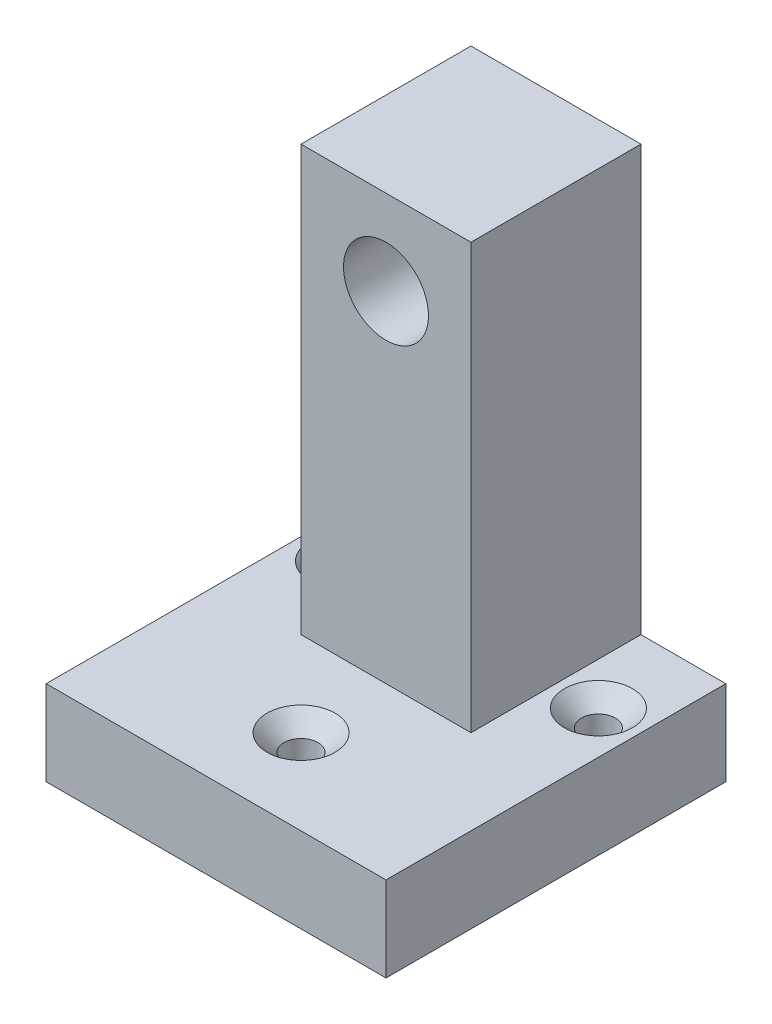
ISO-10303-21;
HEADER;
FILE_DESCRIPTION(('STEP AP214'),'2;1');
FILE_NAME('part.step','',(''),(''),'','','');
FILE_SCHEMA(('AUTOMOTIVE_DESIGN { 1 0 10303 214 1 1 1 1 }'));
ENDSEC;
DATA;
#1=APPLICATION_CONTEXT('core data for automotive mechanical design processes');
#2=APPLICATION_PROTOCOL_DEFINITION('international standard','automotive_design',2000,#1);
#3=PRODUCT_CONTEXT('',#1,'mechanical');
#4=PRODUCT('Part','Part','',(#3));
#5=PRODUCT_RELATED_PRODUCT_CATEGORY('part','',(#4));
#6=PRODUCT_DEFINITION_FORMATION('','',#4);
#7=PRODUCT_DEFINITION_CONTEXT('part definition',#1,'design');
#8=PRODUCT_DEFINITION('design','',#6,#7);
#9=PRODUCT_DEFINITION_SHAPE('','',#8);
#10=(LENGTH_UNIT() NAMED_UNIT(*) SI_UNIT(.MILLI.,.METRE.));
#11=(NAMED_UNIT(*) PLANE_ANGLE_UNIT() SI_UNIT($,.RADIAN.));
#12=(NAMED_UNIT(*) SI_UNIT($,.STERADIAN.) SOLID_ANGLE_UNIT());
#13=UNCERTAINTY_MEASURE_WITH_UNIT(LENGTH_MEASURE(1.E-05),#10,'distance_accuracy_value','');
#14=(GEOMETRIC_REPRESENTATION_CONTEXT(3) GLOBAL_UNCERTAINTY_ASSIGNED_CONTEXT((#13)) GLOBAL_UNIT_ASSIGNED_CONTEXT((#10,
#11,#12)) REPRESENTATION_CONTEXT('',''));
#15=CARTESIAN_POINT('',(0.,0.,0.));
#16=DIRECTION('',(0.,0.,1.));
#17=DIRECTION('',(1.,0.,0.));
#18=AXIS2_PLACEMENT_3D('',#15,#16,#17);
#19=CARTESIAN_POINT('',(-1.95424017064453,6.,2.));
#20=DIRECTION('',(0.,-1.,0.));
#21=DIRECTION('',(0.,0.,-1.));
#22=AXIS2_PLACEMENT_3D('',#19,#20,#21);
#23=PLANE('',#22);
#24=DIRECTION('',(-1.,0.,0.));
#25=VECTOR('',#24,1.);
#26=CARTESIAN_POINT('',(-1.95424017064453,6.,0.));
#27=LINE('',#26,#25);
#28=CARTESIAN_POINT('',(-1.95424017064453,6.,0.));
#29=VERTEX_POINT('',#28);
#30=CARTESIAN_POINT('',(-3.95424017064453,6.,0.));
#31=VERTEX_POINT('',#30);
#32=EDGE_CURVE('E143',#29,#31,#27,.T.);
#33=ORIENTED_EDGE('',*,*,#32,.T.);
#34=DIRECTION('',(0.,0.,-1.));
#35=VECTOR('',#34,1.);
#36=CARTESIAN_POINT('',(-3.95424017064453,6.,2.));
#37=LINE('',#36,#35);
#38=CARTESIAN_POINT('',(-3.95424017064453,6.,2.));
#39=VERTEX_POINT('',#38);
#40=EDGE_CURVE('E168',#39,#31,#37,.T.);
#41=ORIENTED_EDGE('',*,*,#40,.F.);
#42=DIRECTION('',(-1.,0.,0.));
#43=VECTOR('',#42,1.);
#44=CARTESIAN_POINT('',(-1.95424017064453,6.,2.));
#45=LINE('',#44,#43);
#46=CARTESIAN_POINT('',(-1.95424017064453,6.,2.));
#47=VERTEX_POINT('',#46);
#48=EDGE_CURVE('E144',#47,#39,#45,.T.);
#49=ORIENTED_EDGE('',*,*,#48,.F.);
#50=DIRECTION('',(0.,0.,-1.));
#51=VECTOR('',#50,1.);
#52=CARTESIAN_POINT('',(-1.95424017064453,6.,2.));
#53=LINE('',#52,#51);
#54=EDGE_CURVE('E159',#47,#29,#53,.T.);
#55=ORIENTED_EDGE('',*,*,#54,.T.);
#56=EDGE_LOOP('',(#33,#41,#49,#55));
#57=FACE_BOUND('',#56,.T.);
#58=ADVANCED_FACE('F33',(#57),#23,.F.);
#59=CARTESIAN_POINT('',(-3.95424017064453,6.,2.));
#60=DIRECTION('',(1.,0.,0.));
#61=DIRECTION('',(0.,1.,0.));
#62=AXIS2_PLACEMENT_3D('',#59,#60,#61);
#63=PLANE('',#62);
#64=CARTESIAN_POINT('',(-3.95424017064453,5.,1.));
#65=DIRECTION('',(-1.,0.,0.));
#66=DIRECTION('',(0.,-1.,0.));
#67=AXIS2_PLACEMENT_3D('',#64,#65,#66);
#68=CIRCLE('',#67,0.2);
#69=CARTESIAN_POINT('',(-3.95424017064453,4.8,1.));
#70=VERTEX_POINT('',#69);
#71=EDGE_CURVE('E195',#70,#70,#68,.T.);
#72=ORIENTED_EDGE('',*,*,#71,.F.);
#73=EDGE_LOOP('',(#72));
#74=FACE_BOUND('',#73,.T.);
#75=DIRECTION('',(0.,-1.,0.));
#76=VECTOR('',#75,1.);
#77=CARTESIAN_POINT('',(-3.95424017064453,6.,0.));
#78=LINE('',#77,#76);
#79=CARTESIAN_POINT('',(-3.95424017064453,1.,0.));
#80=VERTEX_POINT('',#79);
#81=EDGE_CURVE('E148',#31,#80,#78,.T.);
#82=ORIENTED_EDGE('',*,*,#81,.T.);
#83=DIRECTION('',(0.,0.,-1.));
#84=VECTOR('',#83,1.);
#85=CARTESIAN_POINT('',(-3.95424017064453,1.,2.));
#86=LINE('',#85,#84);
#87=CARTESIAN_POINT('',(-3.95424017064453,1.,2.));
#88=VERTEX_POINT('',#87);
#89=EDGE_CURVE('E119',#88,#80,#86,.T.);
#90=ORIENTED_EDGE('',*,*,#89,.F.);
#91=DIRECTION('',(0.,-1.,0.));
#92=VECTOR('',#91,1.);
#93=CARTESIAN_POINT('',(-3.95424017064453,6.,2.));
#94=LINE('',#93,#92);
#95=EDGE_CURVE('E94',#39,#88,#94,.T.);
#96=ORIENTED_EDGE('',*,*,#95,.F.);
#97=ORIENTED_EDGE('',*,*,#40,.T.);
#98=EDGE_LOOP('',(#82,#90,#96,#97));
#99=FACE_BOUND('',#98,.T.);
#100=ADVANCED_FACE('F226',(#74,#99),#63,.F.);
#101=CARTESIAN_POINT('',(-4.95424017064453,1.,2.));
#102=DIRECTION('',(1.,0.,0.));
#103=DIRECTION('',(0.,0.,-1.));
#104=AXIS2_PLACEMENT_3D('',#101,#102,#103);
#105=PLANE('',#104);
#106=DIRECTION('',(0.,-1.,0.));
#107=VECTOR('',#106,1.);
#108=CARTESIAN_POINT('',(-4.95424017064453,1.,0.));
#109=LINE('',#108,#107);
#110=CARTESIAN_POINT('',(-4.95424017064453,1.,0.));
#111=VERTEX_POINT('',#110);
#112=CARTESIAN_POINT('',(-4.95424017064453,0.,0.));
#113=VERTEX_POINT('',#112);
#114=EDGE_CURVE('E151',#111,#113,#109,.T.);
#115=ORIENTED_EDGE('',*,*,#114,.T.);
#116=DIRECTION('',(0.,0.,-1.));
#117=VECTOR('',#116,1.);
#118=CARTESIAN_POINT('',(-4.95424017064453,0.,2.));
#119=LINE('',#118,#117);
#120=CARTESIAN_POINT('',(-4.95424017064453,0.,4.));
#121=VERTEX_POINT('',#120);
#122=EDGE_CURVE('E120',#121,#113,#119,.T.);
#123=ORIENTED_EDGE('',*,*,#122,.F.);
#124=DIRECTION('',(0.,-1.,0.));
#125=VECTOR('',#124,1.);
#126=CARTESIAN_POINT('',(-4.95424017064453,0.,4.));
#127=LINE('',#126,#125);
#128=CARTESIAN_POINT('',(-4.95424017064453,1.,4.));
#129=VERTEX_POINT('',#128);
#130=EDGE_CURVE('E123',#129,#121,#127,.T.);
#131=ORIENTED_EDGE('',*,*,#130,.F.);
#132=DIRECTION('',(0.,0.,-1.));
#133=VECTOR('',#132,1.);
#134=CARTESIAN_POINT('',(-4.95424017064453,1.,2.));
#135=LINE('',#134,#133);
#136=EDGE_CURVE('E108',#129,#111,#135,.T.);
#137=ORIENTED_EDGE('',*,*,#136,.T.);
#138=EDGE_LOOP('',(#115,#123,#131,#137));
#139=FACE_BOUND('',#138,.T.);
#140=ADVANCED_FACE('F124',(#139),#105,.F.);
#141=CARTESIAN_POINT('',(-4.95424017064453,0.,2.));
#142=DIRECTION('',(0.,1.,0.));
#143=DIRECTION('',(0.,0.,1.));
#144=AXIS2_PLACEMENT_3D('',#141,#142,#143);
#145=PLANE('',#144);
#146=CARTESIAN_POINT('',(-2.95424017064453,0.,3.));
#147=DIRECTION('',(0.,1.,0.));
#148=DIRECTION('',(-1.,0.,0.));
#149=AXIS2_PLACEMENT_3D('',#146,#147,#148);
#150=CIRCLE('',#149,0.2);
#151=CARTESIAN_POINT('',(-3.15424017064453,0.,3.));
#152=VERTEX_POINT('',#151);
#153=EDGE_CURVE('E265',#152,#152,#150,.T.);
#154=ORIENTED_EDGE('',*,*,#153,.T.);
#155=EDGE_LOOP('',(#154));
#156=FACE_BOUND('',#155,.T.);
#157=CARTESIAN_POINT('',(-1.45424017064453,0.,1.));
#158=DIRECTION('',(0.,1.,0.));
#159=DIRECTION('',(-1.,0.,0.));
#160=AXIS2_PLACEMENT_3D('',#157,#158,#159);
#161=CIRCLE('',#160,0.2);
#162=CARTESIAN_POINT('',(-1.65424017064453,0.,1.));
#163=VERTEX_POINT('',#162);
#164=EDGE_CURVE('E260',#163,#163,#161,.T.);
#165=ORIENTED_EDGE('',*,*,#164,.T.);
#166=EDGE_LOOP('',(#165));
#167=FACE_BOUND('',#166,.T.);
#168=CARTESIAN_POINT('',(-4.45424017064453,0.,1.));
#169=DIRECTION('',(0.,1.,0.));
#170=DIRECTION('',(-1.,0.,0.));
#171=AXIS2_PLACEMENT_3D('',#168,#169,#170);
#172=CIRCLE('',#171,0.2);
#173=CARTESIAN_POINT('',(-4.65424017064453,0.,1.));
#174=VERTEX_POINT('',#173);
#175=EDGE_CURVE('E258',#174,#174,#172,.T.);
#176=ORIENTED_EDGE('',*,*,#175,.T.);
#177=EDGE_LOOP('',(#176));
#178=FACE_BOUND('',#177,.T.);
#179=DIRECTION('',(1.,0.,0.));
#180=VECTOR('',#179,1.);
#181=CARTESIAN_POINT('',(-4.95424017064453,0.,0.));
#182=LINE('',#181,#180);
#183=CARTESIAN_POINT('',(-0.95424017064453,0.,0.));
#184=VERTEX_POINT('',#183);
#185=EDGE_CURVE('E153',#113,#184,#182,.T.);
#186=ORIENTED_EDGE('',*,*,#185,.T.);
#187=DIRECTION('',(0.,0.,-1.));
#188=VECTOR('',#187,1.);
#189=CARTESIAN_POINT('',(-0.95424017064453,0.,2.));
#190=LINE('',#189,#188);
#191=CARTESIAN_POINT('',(-0.95424017064453,0.,4.));
#192=VERTEX_POINT('',#191);
#193=EDGE_CURVE('E164',#192,#184,#190,.T.);
#194=ORIENTED_EDGE('',*,*,#193,.F.);
#195=DIRECTION('',(1.,0.,0.));
#196=VECTOR('',#195,1.);
#197=CARTESIAN_POINT('',(-0.95424017064453,0.,4.));
#198=LINE('',#197,#196);
#199=EDGE_CURVE('E129',#121,#192,#198,.T.);
#200=ORIENTED_EDGE('',*,*,#199,.F.);
#201=ORIENTED_EDGE('',*,*,#122,.T.);
#202=EDGE_LOOP('',(#186,#194,#200,#201));
#203=FACE_BOUND('',#202,.T.);
#204=ADVANCED_FACE('F271',(#156,#167,#178,#203),#145,.F.);
#205=CARTESIAN_POINT('',(-0.95424017064453,0.,2.));
#206=DIRECTION('',(-1.,0.,0.));
#207=DIRECTION('',(0.,-1.,0.));
#208=AXIS2_PLACEMENT_3D('',#205,#206,#207);
#209=PLANE('',#208);
#210=DIRECTION('',(0.,1.,0.));
#211=VECTOR('',#210,1.);
#212=CARTESIAN_POINT('',(-0.95424017064453,0.,0.));
#213=LINE('',#212,#211);
#214=CARTESIAN_POINT('',(-0.95424017064453,1.,0.));
#215=VERTEX_POINT('',#214);
#216=EDGE_CURVE('E155',#184,#215,#213,.T.);
#217=ORIENTED_EDGE('',*,*,#216,.T.);
#218=DIRECTION('',(0.,0.,-1.));
#219=VECTOR('',#218,1.);
#220=CARTESIAN_POINT('',(-0.95424017064453,1.,2.));
#221=LINE('',#220,#219);
#222=CARTESIAN_POINT('',(-0.95424017064453,1.,4.));
#223=VERTEX_POINT('',#222);
#224=EDGE_CURVE('E162',#223,#215,#221,.T.);
#225=ORIENTED_EDGE('',*,*,#224,.F.);
#226=DIRECTION('',(0.,1.,0.));
#227=VECTOR('',#226,1.);
#228=CARTESIAN_POINT('',(-0.95424017064453,1.,4.));
#229=LINE('',#228,#227);
#230=EDGE_CURVE('E133',#192,#223,#229,.T.);
#231=ORIENTED_EDGE('',*,*,#230,.F.);
#232=ORIENTED_EDGE('',*,*,#193,.T.);
#233=EDGE_LOOP('',(#217,#225,#231,#232));
#234=FACE_BOUND('',#233,.T.);
#235=ADVANCED_FACE('F274',(#234),#209,.F.);
#236=CARTESIAN_POINT('',(-0.95424017064453,1.,2.));
#237=DIRECTION('',(0.,-1.,0.));
#238=DIRECTION('',(1.,0.,0.));
#239=AXIS2_PLACEMENT_3D('',#236,#237,#238);
#240=PLANE('',#239);
#241=CARTESIAN_POINT('',(-4.45424017064453,0.999999999999999,1.));
#242=DIRECTION('',(0.,-1.,0.));
#243=DIRECTION('',(1.,0.,0.));
#244=AXIS2_PLACEMENT_3D('',#241,#242,#243);
#245=CIRCLE('',#244,0.400000000000003);
#246=CARTESIAN_POINT('',(-4.05424017064453,0.999999999999999,1.));
#247=VERTEX_POINT('',#246);
#248=EDGE_CURVE('E11',#247,#247,#245,.T.);
#249=ORIENTED_EDGE('',*,*,#248,.T.);
#250=EDGE_LOOP('',(#249));
#251=FACE_BOUND('',#250,.T.);
#252=CARTESIAN_POINT('',(-1.45424017064453,1.,1.));
#253=DIRECTION('',(0.,-1.,0.));
#254=DIRECTION('',(1.,0.,0.));
#255=AXIS2_PLACEMENT_3D('',#252,#253,#254);
#256=CIRCLE('',#255,0.400000000000001);
#257=CARTESIAN_POINT('',(-1.05424017064453,1.,1.));
#258=VERTEX_POINT('',#257);
#259=EDGE_CURVE('E244',#258,#258,#256,.T.);
#260=ORIENTED_EDGE('',*,*,#259,.T.);
#261=EDGE_LOOP('',(#260));
#262=FACE_BOUND('',#261,.T.);
#263=CARTESIAN_POINT('',(-2.95424017064453,0.999999999999999,3.));
#264=DIRECTION('',(0.,-1.,0.));
#265=DIRECTION('',(1.,0.,0.));
#266=AXIS2_PLACEMENT_3D('',#263,#264,#265);
#267=CIRCLE('',#266,0.400000000000001);
#268=CARTESIAN_POINT('',(-2.55424017064453,0.999999999999999,3.));
#269=VERTEX_POINT('',#268);
#270=EDGE_CURVE('E248',#269,#269,#267,.T.);
#271=ORIENTED_EDGE('',*,*,#270,.T.);
#272=EDGE_LOOP('',(#271));
#273=FACE_BOUND('',#272,.T.);
#274=DIRECTION('',(-1.,0.,0.));
#275=VECTOR('',#274,1.);
#276=CARTESIAN_POINT('',(-0.95424017064453,1.,0.));
#277=LINE('',#276,#275);
#278=CARTESIAN_POINT('',(-1.95424017064453,1.,0.));
#279=VERTEX_POINT('',#278);
#280=EDGE_CURVE('E80',#215,#279,#277,.T.);
#281=ORIENTED_EDGE('',*,*,#280,.T.);
#282=DIRECTION('',(0.,0.,-1.));
#283=VECTOR('',#282,1.);
#284=CARTESIAN_POINT('',(-1.95424017064453,1.,2.));
#285=LINE('',#284,#283);
#286=CARTESIAN_POINT('',(-1.95424017064453,1.,2.));
#287=VERTEX_POINT('',#286);
#288=EDGE_CURVE('E161',#287,#279,#285,.T.);
#289=ORIENTED_EDGE('',*,*,#288,.F.);
#290=DIRECTION('',(-1.,0.,0.));
#291=VECTOR('',#290,1.);
#292=CARTESIAN_POINT('',(-3.95424017064453,1.,2.));
#293=LINE('',#292,#291);
#294=EDGE_CURVE('E170',#287,#88,#293,.T.);
#295=ORIENTED_EDGE('',*,*,#294,.T.);
#296=ORIENTED_EDGE('',*,*,#89,.T.);
#297=DIRECTION('',(-1.,0.,0.));
#298=VECTOR('',#297,1.);
#299=CARTESIAN_POINT('',(-3.95424017064453,1.,0.));
#300=LINE('',#299,#298);
#301=EDGE_CURVE('E116',#80,#111,#300,.T.);
#302=ORIENTED_EDGE('',*,*,#301,.T.);
#303=ORIENTED_EDGE('',*,*,#136,.F.);
#304=DIRECTION('',(-1.,0.,0.));
#305=VECTOR('',#304,1.);
#306=CARTESIAN_POINT('',(-4.95424017064453,1.,4.));
#307=LINE('',#306,#305);
#308=EDGE_CURVE('E112',#223,#129,#307,.T.);
#309=ORIENTED_EDGE('',*,*,#308,.F.);
#310=ORIENTED_EDGE('',*,*,#224,.T.);
#311=EDGE_LOOP('',(#281,#289,#295,#296,#302,#303,#309,#310));
#312=FACE_BOUND('',#311,.T.);
#313=ADVANCED_FACE('F110',(#251,#262,#273,#312),#240,.F.);
#314=CARTESIAN_POINT('',(-1.95424017064453,1.,2.));
#315=DIRECTION('',(-1.,0.,0.));
#316=DIRECTION('',(0.,0.,1.));
#317=AXIS2_PLACEMENT_3D('',#314,#315,#316);
#318=PLANE('',#317);
#319=DIRECTION('',(0.,1.,0.));
#320=VECTOR('',#319,1.);
#321=CARTESIAN_POINT('',(-1.95424017064453,1.,0.));
#322=LINE('',#321,#320);
#323=EDGE_CURVE('E86',#279,#29,#322,.T.);
#324=ORIENTED_EDGE('',*,*,#323,.T.);
#325=ORIENTED_EDGE('',*,*,#54,.F.);
#326=DIRECTION('',(0.,1.,0.));
#327=VECTOR('',#326,1.);
#328=CARTESIAN_POINT('',(-1.95424017064453,1.,2.));
#329=LINE('',#328,#327);
#330=EDGE_CURVE('E50',#287,#47,#329,.T.);
#331=ORIENTED_EDGE('',*,*,#330,.F.);
#332=ORIENTED_EDGE('',*,*,#288,.T.);
#333=EDGE_LOOP('',(#324,#325,#331,#332));
#334=FACE_BOUND('',#333,.T.);
#335=ADVANCED_FACE('F286',(#334),#318,.F.);
#336=CARTESIAN_POINT('',(0.,0.,2.));
#337=DIRECTION('',(0.,0.,1.));
#338=DIRECTION('',(1.,0.,0.));
#339=AXIS2_PLACEMENT_3D('',#336,#337,#338);
#340=PLANE('',#339);
#341=CARTESIAN_POINT('',(-2.95424017064453,5.,2.));
#342=DIRECTION('',(0.,0.,1.));
#343=DIRECTION('',(1.,0.,0.));
#344=AXIS2_PLACEMENT_3D('',#341,#342,#343);
#345=CIRCLE('',#344,0.5);
#346=CARTESIAN_POINT('',(-2.45424017064453,5.,2.));
#347=VERTEX_POINT('',#346);
#348=EDGE_CURVE('E137',#347,#347,#345,.T.);
#349=ORIENTED_EDGE('',*,*,#348,.F.);
#350=EDGE_LOOP('',(#349));
#351=FACE_BOUND('',#350,.T.);
#352=ORIENTED_EDGE('',*,*,#294,.F.);
#353=ORIENTED_EDGE('',*,*,#330,.T.);
#354=ORIENTED_EDGE('',*,*,#48,.T.);
#355=ORIENTED_EDGE('',*,*,#95,.T.);
#356=EDGE_LOOP('',(#352,#353,#354,#355));
#357=FACE_BOUND('',#356,.T.);
#358=ADVANCED_FACE('F287',(#351,#357),#340,.T.);
#359=CARTESIAN_POINT('',(0.,0.,0.));
#360=DIRECTION('',(0.,0.,1.));
#361=DIRECTION('',(1.,0.,0.));
#362=AXIS2_PLACEMENT_3D('',#359,#360,#361);
#363=PLANE('',#362);
#364=CARTESIAN_POINT('',(-2.95424017064453,5.,0.));
#365=DIRECTION('',(0.,0.,1.));
#366=DIRECTION('',(1.,0.,0.));
#367=AXIS2_PLACEMENT_3D('',#364,#365,#366);
#368=CIRCLE('',#367,0.5);
#369=CARTESIAN_POINT('',(-2.45424017064453,5.,0.));
#370=VERTEX_POINT('',#369);
#371=EDGE_CURVE('E134',#370,#370,#368,.T.);
#372=ORIENTED_EDGE('',*,*,#371,.T.);
#373=EDGE_LOOP('',(#372));
#374=FACE_BOUND('',#373,.T.);
#375=ORIENTED_EDGE('',*,*,#32,.F.);
#376=ORIENTED_EDGE('',*,*,#323,.F.);
#377=ORIENTED_EDGE('',*,*,#280,.F.);
#378=ORIENTED_EDGE('',*,*,#216,.F.);
#379=ORIENTED_EDGE('',*,*,#185,.F.);
#380=ORIENTED_EDGE('',*,*,#114,.F.);
#381=ORIENTED_EDGE('',*,*,#301,.F.);
#382=ORIENTED_EDGE('',*,*,#81,.F.);
#383=EDGE_LOOP('',(#375,#376,#377,#378,#379,#380,#381,#382));
#384=FACE_BOUND('',#383,.T.);
#385=ADVANCED_FACE('F283',(#374,#384),#363,.F.);
#386=CARTESIAN_POINT('',(0.,0.,4.));
#387=DIRECTION('',(0.,0.,-1.));
#388=DIRECTION('',(-1.,0.,0.));
#389=AXIS2_PLACEMENT_3D('',#386,#387,#388);
#390=PLANE('',#389);
#391=ORIENTED_EDGE('',*,*,#308,.T.);
#392=ORIENTED_EDGE('',*,*,#130,.T.);
#393=ORIENTED_EDGE('',*,*,#199,.T.);
#394=ORIENTED_EDGE('',*,*,#230,.T.);
#395=EDGE_LOOP('',(#391,#392,#393,#394));
#396=FACE_BOUND('',#395,.T.);
#397=ADVANCED_FACE('F131',(#396),#390,.F.);
#398=CARTESIAN_POINT('',(-2.95424017064453,5.,0.));
#399=DIRECTION('',(0.,0.,1.));
#400=DIRECTION('',(1.,0.,0.));
#401=AXIS2_PLACEMENT_3D('',#398,#399,#400);
#402=CYLINDRICAL_SURFACE('',#401,0.5);
#403=CARTESIAN_POINT('',(-3.41249774014011,4.8,1.));
#404=CARTESIAN_POINT('',(-3.41249882234721,4.80000117457824,1.01071394981329));
#405=CARTESIAN_POINT('',(-3.4128787731412,4.8008660181402,1.02144305347135));
#406=CARTESIAN_POINT('',(-3.41435108481993,4.8042930969411,1.04259348328682));
#407=CARTESIAN_POINT('',(-3.41544526602805,4.80685966955589,1.05301395170781));
#408=CARTESIAN_POINT('',(-3.41820062643914,4.81357649674303,1.07320529419724));
#409=CARTESIAN_POINT('',(-3.41985966700253,4.81772078474743,1.08297845473609));
#410=CARTESIAN_POINT('',(-3.42355483573892,4.82745797306287,1.1016885050859));
#411=CARTESIAN_POINT('',(-3.42559088154821,4.83305055707326,1.11062557691507));
#412=CARTESIAN_POINT('',(-3.42994103569582,4.84586780254125,1.12792604022416));
#413=CARTESIAN_POINT('',(-3.43226408860334,4.85316206422726,1.13623564229295));
#414=CARTESIAN_POINT('',(-3.43685262762327,4.8690290894226,1.15155289973153));
#415=CARTESIAN_POINT('',(-3.43911809338088,4.87760229783243,1.15856010012898));
#416=CARTESIAN_POINT('',(-3.4434435785514,4.89619936896436,1.17134063969827));
#417=CARTESIAN_POINT('',(-3.4454919743281,4.90626710343877,1.17705443014707));
#418=CARTESIAN_POINT('',(-3.44904409827607,4.92731746771249,1.18668435683898));
#419=CARTESIAN_POINT('',(-3.4505480480292,4.9382997230712,1.19060122457819));
#420=CARTESIAN_POINT('',(-3.45277849565281,4.96030335731611,1.19633414864374));
#421=CARTESIAN_POINT('',(-3.45353910741989,4.97129710151954,1.1982427314089));
#422=CARTESIAN_POINT('',(-3.45432048132723,4.99347336713624,1.20020284856627));
#423=CARTESIAN_POINT('',(-3.45434151941384,5.00465581658254,1.20025507559348));
#424=CARTESIAN_POINT('',(-3.45366213346632,5.02622324947153,1.1985517230225));
#425=CARTESIAN_POINT('',(-3.45300216741638,5.0366177452874,1.19689752272531));
#426=CARTESIAN_POINT('',(-3.4510894621133,5.05696731092183,1.19200071236893));
#427=CARTESIAN_POINT('',(-3.44983667936558,5.06692234843902,1.18875798575996));
#428=CARTESIAN_POINT('',(-3.44683699510229,5.08628979385117,1.18073635171237));
#429=CARTESIAN_POINT('',(-3.44508293111155,5.09569176233796,1.17593502851844));
#430=CARTESIAN_POINT('',(-3.441254755824,5.11358081507406,1.16495349930811));
#431=CARTESIAN_POINT('',(-3.43918053490876,5.12206758427161,1.15877282069026));
#432=CARTESIAN_POINT('',(-3.43476180782376,5.13847688279922,1.14473508640532));
#433=CARTESIAN_POINT('',(-3.43240849716822,5.14632578452737,1.13679461074152));
#434=CARTESIAN_POINT('',(-3.42780183160586,5.16061074153852,1.119700942818));
#435=CARTESIAN_POINT('',(-3.42554850960798,5.16704633437593,1.11054735518494));
#436=CARTESIAN_POINT('',(-3.4213370680996,5.17849041887433,1.09095809775874));
#437=CARTESIAN_POINT('',(-3.41938908487607,5.18345346517362,1.08049351695023));
#438=CARTESIAN_POINT('',(-3.41612776106173,5.1915176259965,1.05877845095519));
#439=CARTESIAN_POINT('',(-3.41481400838068,5.19461994983997,1.04752848152811));
#440=CARTESIAN_POINT('',(-3.41306993049342,5.19869549488229,1.02529642225888));
#441=CARTESIAN_POINT('',(-3.41259053773061,5.19978720968095,1.01433995528528));
#442=CARTESIAN_POINT('',(-3.41242966915392,5.20015613264506,0.992392279216648));
#443=CARTESIAN_POINT('',(-3.41274795137218,5.19943389105848,0.981401081666994));
#444=CARTESIAN_POINT('',(-3.41409621484633,5.19630328947857,0.960354106502403));
#445=CARTESIAN_POINT('',(-3.41508462840062,5.19399330620227,0.950280706259484));
#446=CARTESIAN_POINT('',(-3.41761022171409,5.18788041869121,0.930671159521965));
#447=CARTESIAN_POINT('',(-3.41914752314465,5.18407718343026,0.921135132689423));
#448=CARTESIAN_POINT('',(-3.42267395249264,5.17491356394812,0.902439764220291));
#449=CARTESIAN_POINT('',(-3.42467887528048,5.16949628682645,0.893311381130512));
#450=CARTESIAN_POINT('',(-3.42889055580555,5.15731652244419,0.876051701255877));
#451=CARTESIAN_POINT('',(-3.43109739554147,5.1505534873482,0.867920812720453));
#452=CARTESIAN_POINT('',(-3.43566108661498,5.13528442116805,0.852262659140066));
#453=CARTESIAN_POINT('',(-3.43801697792948,5.12668654294451,0.844824343470894));
#454=CARTESIAN_POINT('',(-3.44245996521234,5.10830836333689,0.83148229233897));
#455=CARTESIAN_POINT('',(-3.44454705023784,5.09852801384679,0.825578619340278));
#456=CARTESIAN_POINT('',(-3.44822388654475,5.07802799340018,0.815495237353876));
#457=CARTESIAN_POINT('',(-3.44981375688479,5.06730854809941,0.811315115583421));
#458=CARTESIAN_POINT('',(-3.45231288411384,5.04523935909192,0.804845114759237));
#459=CARTESIAN_POINT('',(-3.45322251035207,5.03388996102943,0.802554209855993));
#460=CARTESIAN_POINT('',(-3.45421917885504,5.01168165103463,0.800049529837462));
#461=CARTESIAN_POINT('',(-3.45435601738942,5.00083904925931,0.799709987153737));
#462=CARTESIAN_POINT('',(-3.4539262130231,4.97925661642668,0.800785547928408));
#463=CARTESIAN_POINT('',(-3.45335967661136,4.96851677006054,0.802200385778554));
#464=CARTESIAN_POINT('',(-3.45161168400886,4.94778290980536,0.806654678835856));
#465=CARTESIAN_POINT('',(-3.45044965127914,4.93777611953515,0.809642894607584));
#466=CARTESIAN_POINT('',(-3.44763511847629,4.91840776452412,0.817105280456153));
#467=CARTESIAN_POINT('',(-3.4459825279475,4.90904631917331,0.821579724601927));
#468=CARTESIAN_POINT('',(-3.44225826500567,4.89077969581435,0.832110319849047));
#469=CARTESIAN_POINT('',(-3.44017130037688,4.8819129613192,0.838227629488936));
#470=CARTESIAN_POINT('',(-3.43582957382685,4.86529459714775,0.851778851917465));
#471=CARTESIAN_POINT('',(-3.43357474267961,4.857543431426,0.859213309644412));
#472=CARTESIAN_POINT('',(-3.42897793422033,4.84287987349079,0.875731522454204));
#473=CARTESIAN_POINT('',(-3.42663920331279,4.83604911127775,0.884888887346633));
#474=CARTESIAN_POINT('',(-3.42228984205682,4.82401525495841,0.904294213736354));
#475=CARTESIAN_POINT('',(-3.42027925029679,4.81881235221879,0.914542303266591));
#476=CARTESIAN_POINT('',(-3.41699903531753,4.81060089122722,0.934903720200696));
#477=CARTESIAN_POINT('',(-3.41567909002365,4.8074372485591,0.944946523541468));
#478=CARTESIAN_POINT('',(-3.4136861749689,4.8027282241944,0.965448542029543));
#479=CARTESIAN_POINT('',(-3.41301140284085,4.80117833320697,0.97590651161315));
#480=CARTESIAN_POINT('',(-3.41256462934868,4.80015357417058,0.990937756229981));
#481=CARTESIAN_POINT('',(-3.41249728231831,4.7999995031011,0.995467522098365));
#482=CARTESIAN_POINT('',(-3.41249774014011,4.8,1.));
#483=B_SPLINE_CURVE_WITH_KNOTS('',3,(#403,#404,#405,#406,#407,#408,#409,#410,#411,#412,#413,
#414,#415,#416,#417,#418,#419,#420,#421,#422,#423,#424,#425,#426,#427,#428,#429,#430,#431,#432,
#433,#434,#435,#436,#437,#438,#439,#440,#441,#442,#443,#444,#445,#446,#447,#448,#449,#450,#451,
#452,#453,#454,#455,#456,#457,#458,#459,#460,#461,#462,#463,#464,#465,#466,#467,#468,#469,#470,
#471,#472,#473,#474,#475,#476,#477,#478,#479,#480,#481,#482),.UNSPECIFIED.,.T.,.F.,(4,2,2,2,2,2,
2,2,2,2,2,2,2,2,2,2,2,2,2,2,2,2,2,2,2,2,2,2,2,2,2,2,2,2,2,2,2,2,2,4),(0.,0.0321277648767655,
0.0643377335822245,0.0964270823293386,0.128509428823861,0.162255618284424,0.196013574348342,
0.231102669091428,0.266177466969481,0.299554182887184,0.332918445305671,0.364408644830302,
0.39590115512906,0.427868300234898,0.459846414940031,0.493924044081356,0.528012807127127,
0.563064458714576,0.598093304794111,0.630982147495955,0.663861014856835,0.69486724803404,
0.725880358600533,0.758151154601597,0.790435114474745,0.825103734195875,0.859773764801644,
0.894435487261709,0.929078375903032,0.961461039704849,0.993838801461498,1.02522199439225,
1.05661097777748,1.08938705108882,1.1221767165131,1.15699625323451,1.19181988170808,
1.22351666074734,1.25512463012468,1.26871610543216),.UNSPECIFIED.);
#484=CARTESIAN_POINT('',(-3.41249774014011,4.8,1.));
#485=VERTEX_POINT('',#484);
#486=EDGE_CURVE('E188',#485,#485,#483,.T.);
#487=ORIENTED_EDGE('',*,*,#486,.T.);
#488=EDGE_LOOP('',(#487));
#489=FACE_BOUND('',#488,.T.);
#490=ORIENTED_EDGE('',*,*,#371,.F.);
#491=EDGE_LOOP('',(#490));
#492=FACE_BOUND('',#491,.T.);
#493=ORIENTED_EDGE('',*,*,#348,.T.);
#494=EDGE_LOOP('',(#493));
#495=FACE_BOUND('',#494,.T.);
#496=ADVANCED_FACE('F197',(#489,#492,#495),#402,.F.);
#497=CARTESIAN_POINT('',(-2.95424017064453,5.,1.));
#498=DIRECTION('',(-1.,0.,0.));
#499=DIRECTION('',(0.,-1.,0.));
#500=AXIS2_PLACEMENT_3D('',#497,#498,#499);
#501=CYLINDRICAL_SURFACE('',#500,0.2);
#502=ORIENTED_EDGE('',*,*,#71,.T.);
#503=EDGE_LOOP('',(#502));
#504=FACE_BOUND('',#503,.T.);
#505=ORIENTED_EDGE('',*,*,#486,.F.);
#506=EDGE_LOOP('',(#505));
#507=FACE_BOUND('',#506,.T.);
#508=ADVANCED_FACE('F200',(#504,#507),#501,.F.);
#509=CARTESIAN_POINT('',(-4.45424017064453,0.,1.));
#510=DIRECTION('',(0.,1.,0.));
#511=DIRECTION('',(-1.,0.,0.));
#512=AXIS2_PLACEMENT_3D('',#509,#510,#511);
#513=CYLINDRICAL_SURFACE('',#512,0.2);
#514=CARTESIAN_POINT('',(-4.45424017064453,0.799999999999998,1.));
#515=DIRECTION('',(0.,-1.,0.));
#516=DIRECTION('',(1.,0.,0.));
#517=AXIS2_PLACEMENT_3D('',#514,#515,#516);
#518=CIRCLE('',#517,0.2);
#519=CARTESIAN_POINT('',(-4.25424017064453,0.799999999999999,1.));
#520=VERTEX_POINT('',#519);
#521=EDGE_CURVE('E42',#520,#520,#518,.F.);
#522=ORIENTED_EDGE('',*,*,#521,.T.);
#523=EDGE_LOOP('',(#522));
#524=FACE_BOUND('',#523,.T.);
#525=ORIENTED_EDGE('',*,*,#175,.F.);
#526=EDGE_LOOP('',(#525));
#527=FACE_BOUND('',#526,.T.);
#528=ADVANCED_FACE('F204',(#524,#527),#513,.F.);
#529=CARTESIAN_POINT('',(-1.45424017064453,0.,1.));
#530=DIRECTION('',(0.,1.,0.));
#531=DIRECTION('',(-1.,0.,0.));
#532=AXIS2_PLACEMENT_3D('',#529,#530,#531);
#533=CYLINDRICAL_SURFACE('',#532,0.2);
#534=CARTESIAN_POINT('',(-1.45424017064453,0.799999999999999,1.));
#535=DIRECTION('',(0.,-1.,0.));
#536=DIRECTION('',(0.,0.,-1.));
#537=AXIS2_PLACEMENT_3D('',#534,#535,#536);
#538=CIRCLE('',#537,0.2);
#539=CARTESIAN_POINT('',(-1.45424017064453,0.799999999999999,0.8));
#540=VERTEX_POINT('',#539);
#541=EDGE_CURVE('E247',#540,#540,#538,.F.);
#542=ORIENTED_EDGE('',*,*,#541,.T.);
#543=EDGE_LOOP('',(#542));
#544=FACE_BOUND('',#543,.T.);
#545=ORIENTED_EDGE('',*,*,#164,.F.);
#546=EDGE_LOOP('',(#545));
#547=FACE_BOUND('',#546,.T.);
#548=ADVANCED_FACE('F208',(#544,#547),#533,.F.);
#549=CARTESIAN_POINT('',(-2.95424017064453,0.,3.));
#550=DIRECTION('',(0.,1.,0.));
#551=DIRECTION('',(-1.,0.,0.));
#552=AXIS2_PLACEMENT_3D('',#549,#550,#551);
#553=CYLINDRICAL_SURFACE('',#552,0.2);
#554=CARTESIAN_POINT('',(-2.95424017064453,0.799999999999999,3.));
#555=DIRECTION('',(0.,-1.,0.));
#556=DIRECTION('',(0.,0.,-1.));
#557=AXIS2_PLACEMENT_3D('',#554,#555,#556);
#558=CIRCLE('',#557,0.2);
#559=CARTESIAN_POINT('',(-2.95424017064453,0.799999999999999,2.8));
#560=VERTEX_POINT('',#559);
#561=EDGE_CURVE('E175',#560,#560,#558,.F.);
#562=ORIENTED_EDGE('',*,*,#561,.T.);
#563=EDGE_LOOP('',(#562));
#564=FACE_BOUND('',#563,.T.);
#565=ORIENTED_EDGE('',*,*,#153,.F.);
#566=EDGE_LOOP('',(#565));
#567=FACE_BOUND('',#566,.T.);
#568=ADVANCED_FACE('F212',(#564,#567),#553,.F.);
#569=CARTESIAN_POINT('',(-2.95424017064453,0.799999999999999,3.));
#570=DIRECTION('',(0.,1.,0.));
#571=DIRECTION('',(0.,0.,1.));
#572=AXIS2_PLACEMENT_3D('',#569,#570,#571);
#573=CONICAL_SURFACE('',#572,0.2,0.78539816339745);
#574=ORIENTED_EDGE('',*,*,#270,.F.);
#575=EDGE_LOOP('',(#574));
#576=FACE_BOUND('',#575,.T.);
#577=ORIENTED_EDGE('',*,*,#561,.F.);
#578=EDGE_LOOP('',(#577));
#579=FACE_BOUND('',#578,.T.);
#580=ADVANCED_FACE('F215',(#576,#579),#573,.F.);
#581=CARTESIAN_POINT('',(-1.45424017064453,0.8,1.));
#582=DIRECTION('',(0.,1.,0.));
#583=DIRECTION('',(0.,0.,1.));
#584=AXIS2_PLACEMENT_3D('',#581,#582,#583);
#585=CONICAL_SURFACE('',#584,0.2,0.78539816339745);
#586=ORIENTED_EDGE('',*,*,#259,.F.);
#587=EDGE_LOOP('',(#586));
#588=FACE_BOUND('',#587,.T.);
#589=ORIENTED_EDGE('',*,*,#541,.F.);
#590=EDGE_LOOP('',(#589));
#591=FACE_BOUND('',#590,.T.);
#592=ADVANCED_FACE('F220',(#588,#591),#585,.F.);
#593=CARTESIAN_POINT('',(-4.45424017064453,0.799999999999998,1.));
#594=DIRECTION('',(0.,1.,0.));
#595=DIRECTION('',(-1.,0.,0.));
#596=AXIS2_PLACEMENT_3D('',#593,#594,#595);
#597=CONICAL_SURFACE('',#596,0.2,0.785398163397451);
#598=ORIENTED_EDGE('',*,*,#248,.F.);
#599=EDGE_LOOP('',(#598));
#600=FACE_BOUND('',#599,.T.);
#601=ORIENTED_EDGE('',*,*,#521,.F.);
#602=EDGE_LOOP('',(#601));
#603=FACE_BOUND('',#602,.T.);
#604=ADVANCED_FACE('F35',(#600,#603),#597,.F.);
#605=CLOSED_SHELL('',(#58,#100,#140,#204,#235,#313,#335,#358,#385,#397,#496,#508,#528,#548,#568,
#580,#592,#604));
#606=MANIFOLD_SOLID_BREP('B2',#605);
#607=ADVANCED_BREP_SHAPE_REPRESENTATION('',(#18,#606),#14);
#608=SHAPE_DEFINITION_REPRESENTATION(#9,#607);
ENDSEC;
END-ISO-10303-21;
